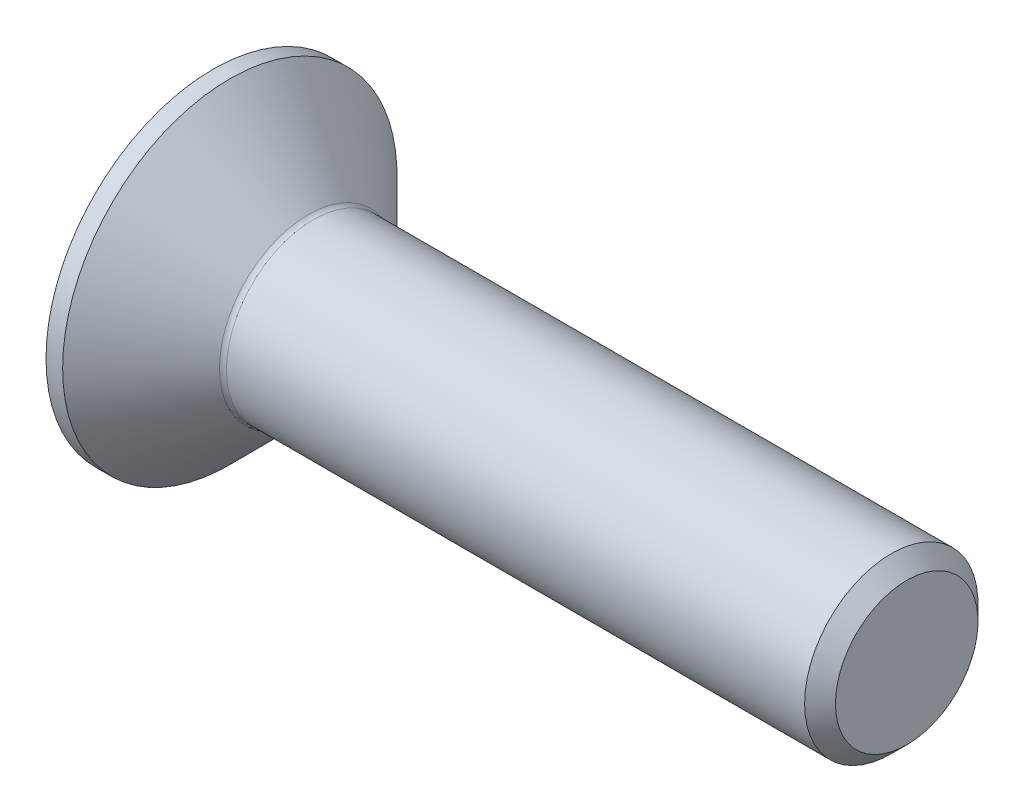
ISO-10303-21;
HEADER;
FILE_DESCRIPTION(('STEP AP214'),'2;1');
FILE_NAME('part.step','',(''),(''),'','','');
FILE_SCHEMA(('AUTOMOTIVE_DESIGN { 1 0 10303 214 1 1 1 1 }'));
ENDSEC;
DATA;
#1=APPLICATION_CONTEXT('core data for automotive mechanical design processes');
#2=APPLICATION_PROTOCOL_DEFINITION('international standard','automotive_design',2000,#1);
#3=PRODUCT_CONTEXT('',#1,'mechanical');
#4=PRODUCT('Part','Part','',(#3));
#5=PRODUCT_RELATED_PRODUCT_CATEGORY('part','',(#4));
#6=PRODUCT_DEFINITION_FORMATION('','',#4);
#7=PRODUCT_DEFINITION_CONTEXT('part definition',#1,'design');
#8=PRODUCT_DEFINITION('design','',#6,#7);
#9=PRODUCT_DEFINITION_SHAPE('','',#8);
#10=(LENGTH_UNIT() NAMED_UNIT(*) SI_UNIT(.MILLI.,.METRE.));
#11=(NAMED_UNIT(*) PLANE_ANGLE_UNIT() SI_UNIT($,.RADIAN.));
#12=(NAMED_UNIT(*) SI_UNIT($,.STERADIAN.) SOLID_ANGLE_UNIT());
#13=UNCERTAINTY_MEASURE_WITH_UNIT(LENGTH_MEASURE(1.E-05),#10,'distance_accuracy_value','');
#14=(GEOMETRIC_REPRESENTATION_CONTEXT(3) GLOBAL_UNCERTAINTY_ASSIGNED_CONTEXT((#13)) GLOBAL_UNIT_ASSIGNED_CONTEXT((#10,
#11,#12)) REPRESENTATION_CONTEXT('',''));
#15=CARTESIAN_POINT('',(0.,0.,0.));
#16=DIRECTION('',(0.,0.,1.));
#17=DIRECTION('',(1.,0.,0.));
#18=AXIS2_PLACEMENT_3D('',#15,#16,#17);
#19=CARTESIAN_POINT('',(0.,0.,0.));
#20=DIRECTION('',(-1.,0.,0.));
#21=DIRECTION('',(0.,0.,1.));
#22=AXIS2_PLACEMENT_3D('',#19,#20,#21);
#23=PLANE('',#22);
#24=CARTESIAN_POINT('',(0.,0.,0.));
#25=DIRECTION('',(-1.,0.,0.));
#26=DIRECTION('',(0.,0.,1.));
#27=AXIS2_PLACEMENT_3D('',#24,#25,#26);
#28=CIRCLE('',#27,4.82);
#29=CARTESIAN_POINT('',(0.,0.,4.82));
#30=VERTEX_POINT('',#29);
#31=EDGE_CURVE('E153',#30,#30,#28,.T.);
#32=ORIENTED_EDGE('',*,*,#31,.T.);
#33=EDGE_LOOP('',(#32));
#34=FACE_BOUND('',#33,.T.);
#35=DIRECTION('',(0.,-0.499999999999999,-0.866025403784439));
#36=VECTOR('',#35,1.);
#37=CARTESIAN_POINT('',(0.,-0.871798906476334,1.51));
#38=LINE('',#37,#36);
#39=CARTESIAN_POINT('',(0.,-0.871798906476334,1.51));
#40=VERTEX_POINT('',#39);
#41=CARTESIAN_POINT('',(0.,-1.74359781295267,0.));
#42=VERTEX_POINT('',#41);
#43=EDGE_CURVE('E119',#40,#42,#38,.T.);
#44=ORIENTED_EDGE('',*,*,#43,.T.);
#45=DIRECTION('',(0.,0.499999999999999,-0.866025403784439));
#46=VECTOR('',#45,1.);
#47=CARTESIAN_POINT('',(0.,-1.74359781295267,0.));
#48=LINE('',#47,#46);
#49=CARTESIAN_POINT('',(0.,-0.871798906476335,-1.51));
#50=VERTEX_POINT('',#49);
#51=EDGE_CURVE('E50',#42,#50,#48,.T.);
#52=ORIENTED_EDGE('',*,*,#51,.T.);
#53=DIRECTION('',(0.,1.,0.));
#54=VECTOR('',#53,1.);
#55=CARTESIAN_POINT('',(0.,-0.871798906476335,-1.51));
#56=LINE('',#55,#54);
#57=CARTESIAN_POINT('',(0.,0.871798906476334,-1.51));
#58=VERTEX_POINT('',#57);
#59=EDGE_CURVE('E130',#50,#58,#56,.T.);
#60=ORIENTED_EDGE('',*,*,#59,.T.);
#61=DIRECTION('',(0.,0.500000000000002,0.866025403784437));
#62=VECTOR('',#61,1.);
#63=CARTESIAN_POINT('',(0.,0.871798906476334,-1.51));
#64=LINE('',#63,#62);
#65=CARTESIAN_POINT('',(0.,1.74359781295267,0.));
#66=VERTEX_POINT('',#65);
#67=EDGE_CURVE('E254',#58,#66,#64,.T.);
#68=ORIENTED_EDGE('',*,*,#67,.T.);
#69=DIRECTION('',(0.,-0.500000000000001,0.866025403784438));
#70=VECTOR('',#69,1.);
#71=CARTESIAN_POINT('',(0.,1.74359781295267,0.));
#72=LINE('',#71,#70);
#73=CARTESIAN_POINT('',(0.,0.871798906476334,1.51));
#74=VERTEX_POINT('',#73);
#75=EDGE_CURVE('E257',#66,#74,#72,.T.);
#76=ORIENTED_EDGE('',*,*,#75,.T.);
#77=DIRECTION('',(0.,-1.,0.));
#78=VECTOR('',#77,1.);
#79=CARTESIAN_POINT('',(0.,0.871798906476334,1.51));
#80=LINE('',#79,#78);
#81=EDGE_CURVE('E260',#74,#40,#80,.T.);
#82=ORIENTED_EDGE('',*,*,#81,.T.);
#83=EDGE_LOOP('',(#44,#52,#60,#68,#76,#82));
#84=FACE_BOUND('',#83,.T.);
#85=ADVANCED_FACE('F35',(#34,#84),#23,.T.);
#86=CARTESIAN_POINT('',(0.,0.,0.));
#87=DIRECTION('',(-1.,0.,0.));
#88=DIRECTION('',(0.,0.,1.));
#89=AXIS2_PLACEMENT_3D('',#86,#87,#88);
#90=CYLINDRICAL_SURFACE('',#89,4.82);
#91=CARTESIAN_POINT('',(0.480000000000012,0.,0.));
#92=DIRECTION('',(-1.,0.,0.));
#93=DIRECTION('',(0.,0.,1.));
#94=AXIS2_PLACEMENT_3D('',#91,#92,#93);
#95=CIRCLE('',#94,4.82);
#96=CARTESIAN_POINT('',(0.480000000000012,0.,4.82));
#97=VERTEX_POINT('',#96);
#98=EDGE_CURVE('E150',#97,#97,#95,.T.);
#99=ORIENTED_EDGE('',*,*,#98,.T.);
#100=EDGE_LOOP('',(#99));
#101=FACE_BOUND('',#100,.T.);
#102=ORIENTED_EDGE('',*,*,#31,.F.);
#103=EDGE_LOOP('',(#102));
#104=FACE_BOUND('',#103,.T.);
#105=ADVANCED_FACE('F174',(#101,#104),#90,.T.);
#106=CARTESIAN_POINT('',(0.480000000000012,0.,0.));
#107=DIRECTION('',(-1.,0.,0.));
#108=DIRECTION('',(0.,0.,1.));
#109=AXIS2_PLACEMENT_3D('',#106,#107,#108);
#110=CONICAL_SURFACE('',#109,4.82,0.78539816339745);
#111=CARTESIAN_POINT('',(2.74142135623747,0.,0.));
#112=DIRECTION('',(-1.,0.,0.));
#113=DIRECTION('',(0.,0.,1.));
#114=AXIS2_PLACEMENT_3D('',#111,#112,#113);
#115=CIRCLE('',#114,2.55857864376254);
#116=CARTESIAN_POINT('',(2.74142135623747,0.,2.55857864376254));
#117=VERTEX_POINT('',#116);
#118=EDGE_CURVE('E43',#117,#117,#115,.T.);
#119=ORIENTED_EDGE('',*,*,#118,.T.);
#120=EDGE_LOOP('',(#119));
#121=FACE_BOUND('',#120,.T.);
#122=ORIENTED_EDGE('',*,*,#98,.F.);
#123=EDGE_LOOP('',(#122));
#124=FACE_BOUND('',#123,.T.);
#125=ADVANCED_FACE('F158',(#121,#124),#110,.T.);
#126=CARTESIAN_POINT('',(0.,0.,0.));
#127=DIRECTION('',(-1.,0.,0.));
#128=DIRECTION('',(0.,0.,1.));
#129=AXIS2_PLACEMENT_3D('',#126,#127,#128);
#130=CYLINDRICAL_SURFACE('',#129,2.49999999999985);
#131=CARTESIAN_POINT('',(2.88284271247478,0.,0.));
#132=DIRECTION('',(-1.,0.,0.));
#133=DIRECTION('',(0.,0.,1.));
#134=AXIS2_PLACEMENT_3D('',#131,#132,#133);
#135=CIRCLE('',#134,2.49999999999985);
#136=CARTESIAN_POINT('',(2.88284271247478,0.,2.49999999999985));
#137=VERTEX_POINT('',#136);
#138=EDGE_CURVE('E11',#137,#137,#135,.F.);
#139=ORIENTED_EDGE('',*,*,#138,.T.);
#140=EDGE_LOOP('',(#139));
#141=FACE_BOUND('',#140,.T.);
#142=CARTESIAN_POINT('',(19.5549999999997,0.,0.));
#143=DIRECTION('',(-1.,0.,0.));
#144=DIRECTION('',(0.,0.,1.));
#145=AXIS2_PLACEMENT_3D('',#142,#143,#144);
#146=CIRCLE('',#145,2.49999999999969);
#147=CARTESIAN_POINT('',(19.5549999999997,0.,2.49999999999969));
#148=VERTEX_POINT('',#147);
#149=EDGE_CURVE('E147',#148,#148,#146,.T.);
#150=ORIENTED_EDGE('',*,*,#149,.T.);
#151=EDGE_LOOP('',(#150));
#152=FACE_BOUND('',#151,.T.);
#153=ADVANCED_FACE('F185',(#141,#152),#130,.T.);
#154=CARTESIAN_POINT('',(20.,0.,0.));
#155=DIRECTION('',(-1.,0.,0.));
#156=DIRECTION('',(0.,0.,1.));
#157=AXIS2_PLACEMENT_3D('',#154,#155,#156);
#158=CONICAL_SURFACE('',#157,2.055,0.785398163396776);
#159=ORIENTED_EDGE('',*,*,#149,.F.);
#160=EDGE_LOOP('',(#159));
#161=FACE_BOUND('',#160,.T.);
#162=CARTESIAN_POINT('',(20.,0.,0.));
#163=DIRECTION('',(-1.,0.,0.));
#164=DIRECTION('',(0.,0.,1.));
#165=AXIS2_PLACEMENT_3D('',#162,#163,#164);
#166=CIRCLE('',#165,2.055);
#167=CARTESIAN_POINT('',(20.,0.,2.055));
#168=VERTEX_POINT('',#167);
#169=EDGE_CURVE('E143',#168,#168,#166,.T.);
#170=ORIENTED_EDGE('',*,*,#169,.T.);
#171=EDGE_LOOP('',(#170));
#172=FACE_BOUND('',#171,.T.);
#173=ADVANCED_FACE('F169',(#161,#172),#158,.T.);
#174=CARTESIAN_POINT('',(20.,2.055,0.));
#175=DIRECTION('',(1.,0.,0.));
#176=DIRECTION('',(0.,0.,-1.));
#177=AXIS2_PLACEMENT_3D('',#174,#175,#176);
#178=PLANE('',#177);
#179=ORIENTED_EDGE('',*,*,#169,.F.);
#180=EDGE_LOOP('',(#179));
#181=FACE_BOUND('',#180,.T.);
#182=ADVANCED_FACE('F162',(#181),#178,.T.);
#183=CARTESIAN_POINT('',(2.88284271247478,0.,0.));
#184=DIRECTION('',(-1.,0.,0.));
#185=DIRECTION('',(0.,0.,1.));
#186=AXIS2_PLACEMENT_3D('',#183,#184,#185);
#187=TOROIDAL_SURFACE('',#186,2.69999999999985,0.2);
#188=ORIENTED_EDGE('',*,*,#138,.F.);
#189=EDGE_LOOP('',(#188));
#190=FACE_BOUND('',#189,.T.);
#191=ORIENTED_EDGE('',*,*,#118,.F.);
#192=EDGE_LOOP('',(#191));
#193=FACE_BOUND('',#192,.T.);
#194=ADVANCED_FACE('F37',(#190,#193),#187,.F.);
#195=CARTESIAN_POINT('',(2.3,-1.74359781295267,0.));
#196=DIRECTION('',(0.,0.866025403784439,0.499999999999999));
#197=DIRECTION('',(0.,-0.499999999999999,0.866025403784439));
#198=AXIS2_PLACEMENT_3D('',#195,#196,#197);
#199=PLANE('',#198);
#200=ORIENTED_EDGE('',*,*,#51,.F.);
#201=DIRECTION('',(-1.,0.,0.));
#202=VECTOR('',#201,1.);
#203=CARTESIAN_POINT('',(2.3,-1.74359781295267,0.));
#204=LINE('',#203,#202);
#205=CARTESIAN_POINT('',(2.3,-1.74359781295267,0.));
#206=VERTEX_POINT('',#205);
#207=EDGE_CURVE('E251',#206,#42,#204,.T.);
#208=ORIENTED_EDGE('',*,*,#207,.F.);
#209=DIRECTION('',(0.,0.499999999999999,-0.866025403784439));
#210=VECTOR('',#209,1.);
#211=CARTESIAN_POINT('',(2.3,-1.74359781295267,0.));
#212=LINE('',#211,#210);
#213=CARTESIAN_POINT('',(2.3,-1.3076983597145,-0.754999999999997));
#214=VERTEX_POINT('',#213);
#215=EDGE_CURVE('E115',#206,#214,#212,.T.);
#216=ORIENTED_EDGE('',*,*,#215,.T.);
#217=CARTESIAN_POINT('',(2.3,-0.871798906476335,-1.51));
#218=VERTEX_POINT('',#217);
#219=EDGE_CURVE('E111',#214,#218,#212,.T.);
#220=ORIENTED_EDGE('',*,*,#219,.T.);
#221=DIRECTION('',(-1.,0.,0.));
#222=VECTOR('',#221,1.);
#223=CARTESIAN_POINT('',(2.3,-0.871798906476335,-1.51));
#224=LINE('',#223,#222);
#225=EDGE_CURVE('E113',#218,#50,#224,.T.);
#226=ORIENTED_EDGE('',*,*,#225,.T.);
#227=EDGE_LOOP('',(#200,#208,#216,#220,#226));
#228=FACE_BOUND('',#227,.T.);
#229=ADVANCED_FACE('F112',(#228),#199,.T.);
#230=CARTESIAN_POINT('',(2.3,-0.871798906476335,-1.51));
#231=DIRECTION('',(0.,0.,1.));
#232=DIRECTION('',(0.,-1.,0.));
#233=AXIS2_PLACEMENT_3D('',#230,#231,#232);
#234=PLANE('',#233);
#235=ORIENTED_EDGE('',*,*,#59,.F.);
#236=ORIENTED_EDGE('',*,*,#225,.F.);
#237=DIRECTION('',(0.,1.,0.));
#238=VECTOR('',#237,1.);
#239=CARTESIAN_POINT('',(2.3,-0.871798906476335,-1.51));
#240=LINE('',#239,#238);
#241=CARTESIAN_POINT('',(2.3,0.,-1.51));
#242=VERTEX_POINT('',#241);
#243=EDGE_CURVE('E58',#218,#242,#240,.T.);
#244=ORIENTED_EDGE('',*,*,#243,.T.);
#245=CARTESIAN_POINT('',(2.3,0.871798906476334,-1.51));
#246=VERTEX_POINT('',#245);
#247=EDGE_CURVE('E125',#242,#246,#240,.T.);
#248=ORIENTED_EDGE('',*,*,#247,.T.);
#249=DIRECTION('',(-1.,0.,0.));
#250=VECTOR('',#249,1.);
#251=CARTESIAN_POINT('',(2.3,0.871798906476334,-1.51));
#252=LINE('',#251,#250);
#253=EDGE_CURVE('E132',#246,#58,#252,.T.);
#254=ORIENTED_EDGE('',*,*,#253,.T.);
#255=EDGE_LOOP('',(#235,#236,#244,#248,#254));
#256=FACE_BOUND('',#255,.T.);
#257=ADVANCED_FACE('F127',(#256),#234,.T.);
#258=CARTESIAN_POINT('',(2.3,0.871798906476334,-1.51));
#259=DIRECTION('',(0.,-0.866025403784437,0.500000000000002));
#260=DIRECTION('',(0.,-0.500000000000002,-0.866025403784437));
#261=AXIS2_PLACEMENT_3D('',#258,#259,#260);
#262=PLANE('',#261);
#263=ORIENTED_EDGE('',*,*,#67,.F.);
#264=ORIENTED_EDGE('',*,*,#253,.F.);
#265=DIRECTION('',(0.,0.500000000000002,0.866025403784437));
#266=VECTOR('',#265,1.);
#267=CARTESIAN_POINT('',(2.3,0.871798906476334,-1.51));
#268=LINE('',#267,#266);
#269=CARTESIAN_POINT('',(2.3,1.3076983597145,-0.755000000000003));
#270=VERTEX_POINT('',#269);
#271=EDGE_CURVE('E232',#246,#270,#268,.T.);
#272=ORIENTED_EDGE('',*,*,#271,.T.);
#273=CARTESIAN_POINT('',(2.3,1.74359781295267,0.));
#274=VERTEX_POINT('',#273);
#275=EDGE_CURVE('E124',#270,#274,#268,.T.);
#276=ORIENTED_EDGE('',*,*,#275,.T.);
#277=DIRECTION('',(-1.,0.,0.));
#278=VECTOR('',#277,1.);
#279=CARTESIAN_POINT('',(2.3,1.74359781295267,0.));
#280=LINE('',#279,#278);
#281=EDGE_CURVE('E138',#274,#66,#280,.T.);
#282=ORIENTED_EDGE('',*,*,#281,.T.);
#283=EDGE_LOOP('',(#263,#264,#272,#276,#282));
#284=FACE_BOUND('',#283,.T.);
#285=ADVANCED_FACE('F199',(#284),#262,.T.);
#286=CARTESIAN_POINT('',(2.3,1.74359781295267,0.));
#287=DIRECTION('',(0.,-0.866025403784438,-0.500000000000001));
#288=DIRECTION('',(0.,0.500000000000001,-0.866025403784438));
#289=AXIS2_PLACEMENT_3D('',#286,#287,#288);
#290=PLANE('',#289);
#291=ORIENTED_EDGE('',*,*,#75,.F.);
#292=ORIENTED_EDGE('',*,*,#281,.F.);
#293=DIRECTION('',(0.,-0.500000000000001,0.866025403784438));
#294=VECTOR('',#293,1.);
#295=CARTESIAN_POINT('',(2.3,1.74359781295267,0.));
#296=LINE('',#295,#294);
#297=CARTESIAN_POINT('',(2.3,1.3076983597145,0.755000000000001));
#298=VERTEX_POINT('',#297);
#299=EDGE_CURVE('E239',#274,#298,#296,.T.);
#300=ORIENTED_EDGE('',*,*,#299,.T.);
#301=CARTESIAN_POINT('',(2.3,0.871798906476334,1.51));
#302=VERTEX_POINT('',#301);
#303=EDGE_CURVE('E237',#298,#302,#296,.T.);
#304=ORIENTED_EDGE('',*,*,#303,.T.);
#305=DIRECTION('',(-1.,0.,0.));
#306=VECTOR('',#305,1.);
#307=CARTESIAN_POINT('',(2.3,0.871798906476334,1.51));
#308=LINE('',#307,#306);
#309=EDGE_CURVE('E269',#302,#74,#308,.T.);
#310=ORIENTED_EDGE('',*,*,#309,.T.);
#311=EDGE_LOOP('',(#291,#292,#300,#304,#310));
#312=FACE_BOUND('',#311,.T.);
#313=ADVANCED_FACE('F202',(#312),#290,.T.);
#314=CARTESIAN_POINT('',(2.3,0.871798906476334,1.51));
#315=DIRECTION('',(0.,0.,-1.));
#316=DIRECTION('',(-1.,0.,0.));
#317=AXIS2_PLACEMENT_3D('',#314,#315,#316);
#318=PLANE('',#317);
#319=ORIENTED_EDGE('',*,*,#81,.F.);
#320=ORIENTED_EDGE('',*,*,#309,.F.);
#321=DIRECTION('',(0.,-1.,0.));
#322=VECTOR('',#321,1.);
#323=CARTESIAN_POINT('',(2.3,0.871798906476334,1.51));
#324=LINE('',#323,#322);
#325=CARTESIAN_POINT('',(2.3,0.,1.51));
#326=VERTEX_POINT('',#325);
#327=EDGE_CURVE('E244',#302,#326,#324,.T.);
#328=ORIENTED_EDGE('',*,*,#327,.T.);
#329=CARTESIAN_POINT('',(2.3,-0.871798906476334,1.51));
#330=VERTEX_POINT('',#329);
#331=EDGE_CURVE('E243',#326,#330,#324,.T.);
#332=ORIENTED_EDGE('',*,*,#331,.T.);
#333=DIRECTION('',(-1.,0.,0.));
#334=VECTOR('',#333,1.);
#335=CARTESIAN_POINT('',(2.3,-0.871798906476334,1.51));
#336=LINE('',#335,#334);
#337=EDGE_CURVE('E266',#330,#40,#336,.T.);
#338=ORIENTED_EDGE('',*,*,#337,.T.);
#339=EDGE_LOOP('',(#319,#320,#328,#332,#338));
#340=FACE_BOUND('',#339,.T.);
#341=ADVANCED_FACE('F206',(#340),#318,.T.);
#342=CARTESIAN_POINT('',(2.3,-0.871798906476334,1.51));
#343=DIRECTION('',(0.,0.866025403784439,-0.499999999999999));
#344=DIRECTION('',(0.,0.499999999999999,0.866025403784439));
#345=AXIS2_PLACEMENT_3D('',#342,#343,#344);
#346=PLANE('',#345);
#347=ORIENTED_EDGE('',*,*,#43,.F.);
#348=ORIENTED_EDGE('',*,*,#337,.F.);
#349=DIRECTION('',(0.,-0.499999999999999,-0.866025403784439));
#350=VECTOR('',#349,1.);
#351=CARTESIAN_POINT('',(2.3,-0.871798906476334,1.51));
#352=LINE('',#351,#350);
#353=CARTESIAN_POINT('',(2.3,-1.3076983597145,0.754999999999998));
#354=VERTEX_POINT('',#353);
#355=EDGE_CURVE('E248',#330,#354,#352,.T.);
#356=ORIENTED_EDGE('',*,*,#355,.T.);
#357=EDGE_CURVE('E247',#354,#206,#352,.T.);
#358=ORIENTED_EDGE('',*,*,#357,.T.);
#359=ORIENTED_EDGE('',*,*,#207,.T.);
#360=EDGE_LOOP('',(#347,#348,#356,#358,#359));
#361=FACE_BOUND('',#360,.T.);
#362=ADVANCED_FACE('F210',(#361),#346,.T.);
#363=CARTESIAN_POINT('',(2.3,-0.871798906476334,-1.51));
#364=DIRECTION('',(1.,0.,0.));
#365=DIRECTION('',(0.,0.,-1.));
#366=AXIS2_PLACEMENT_3D('',#363,#364,#365);
#367=PLANE('',#366);
#368=ORIENTED_EDGE('',*,*,#243,.F.);
#369=ORIENTED_EDGE('',*,*,#219,.F.);
#370=CARTESIAN_POINT('',(2.3,0.,0.));
#371=DIRECTION('',(-1.,0.,0.));
#372=DIRECTION('',(0.,0.,1.));
#373=AXIS2_PLACEMENT_3D('',#370,#371,#372);
#374=CIRCLE('',#373,1.51);
#375=EDGE_CURVE('E122',#242,#214,#374,.T.);
#376=ORIENTED_EDGE('',*,*,#375,.F.);
#377=EDGE_LOOP('',(#368,#369,#376));
#378=FACE_BOUND('',#377,.T.);
#379=ADVANCED_FACE('F121',(#378),#367,.F.);
#380=ORIENTED_EDGE('',*,*,#215,.F.);
#381=ORIENTED_EDGE('',*,*,#357,.F.);
#382=EDGE_CURVE('E135',#214,#354,#374,.T.);
#383=ORIENTED_EDGE('',*,*,#382,.F.);
#384=EDGE_LOOP('',(#380,#381,#383));
#385=FACE_BOUND('',#384,.T.);
#386=ADVANCED_FACE('F216',(#385),#367,.F.);
#387=ORIENTED_EDGE('',*,*,#355,.F.);
#388=ORIENTED_EDGE('',*,*,#331,.F.);
#389=EDGE_CURVE('E131',#354,#326,#374,.T.);
#390=ORIENTED_EDGE('',*,*,#389,.F.);
#391=EDGE_LOOP('',(#387,#388,#390));
#392=FACE_BOUND('',#391,.T.);
#393=ADVANCED_FACE('F220',(#392),#367,.F.);
#394=ORIENTED_EDGE('',*,*,#327,.F.);
#395=ORIENTED_EDGE('',*,*,#303,.F.);
#396=EDGE_CURVE('E137',#326,#298,#374,.T.);
#397=ORIENTED_EDGE('',*,*,#396,.F.);
#398=EDGE_LOOP('',(#394,#395,#397));
#399=FACE_BOUND('',#398,.T.);
#400=ADVANCED_FACE('F228',(#399),#367,.F.);
#401=ORIENTED_EDGE('',*,*,#299,.F.);
#402=ORIENTED_EDGE('',*,*,#275,.F.);
#403=EDGE_CURVE('E144',#298,#270,#374,.T.);
#404=ORIENTED_EDGE('',*,*,#403,.F.);
#405=EDGE_LOOP('',(#401,#402,#404));
#406=FACE_BOUND('',#405,.T.);
#407=ADVANCED_FACE('F223',(#406),#367,.F.);
#408=ORIENTED_EDGE('',*,*,#271,.F.);
#409=ORIENTED_EDGE('',*,*,#247,.F.);
#410=EDGE_CURVE('E233',#270,#242,#374,.T.);
#411=ORIENTED_EDGE('',*,*,#410,.F.);
#412=EDGE_LOOP('',(#408,#409,#411));
#413=FACE_BOUND('',#412,.T.);
#414=ADVANCED_FACE('F194',(#413),#367,.F.);
#415=CARTESIAN_POINT('',(2.3,0.,0.));
#416=DIRECTION('',(-1.,0.,0.));
#417=DIRECTION('',(0.,0.,1.));
#418=AXIS2_PLACEMENT_3D('',#415,#416,#417);
#419=CONICAL_SURFACE('',#418,1.51,1.04719755119659);
#420=CARTESIAN_POINT('',(3.17179890647634,0.,0.));
#421=VERTEX_POINT('',#420);
#422=VERTEX_LOOP('',#421);
#423=FACE_BOUND('',#422,.T.);
#424=ORIENTED_EDGE('',*,*,#396,.T.);
#425=ORIENTED_EDGE('',*,*,#403,.T.);
#426=ORIENTED_EDGE('',*,*,#410,.T.);
#427=ORIENTED_EDGE('',*,*,#375,.T.);
#428=ORIENTED_EDGE('',*,*,#382,.T.);
#429=ORIENTED_EDGE('',*,*,#389,.T.);
#430=EDGE_LOOP('',(#424,#425,#426,#427,#428,#429));
#431=FACE_BOUND('',#430,.T.);
#432=ADVANCED_FACE('F192',(#423,#431),#419,.F.);
#433=CLOSED_SHELL('',(#85,#105,#125,#153,#173,#182,#194,#229,#257,#285,#313,#341,#362,#379,#386,
#393,#400,#407,#414,#432));
#434=MANIFOLD_SOLID_BREP('B2',#433);
#435=ADVANCED_BREP_SHAPE_REPRESENTATION('',(#18,#434),#14);
#436=SHAPE_DEFINITION_REPRESENTATION(#9,#435);
ENDSEC;
END-ISO-10303-21;
